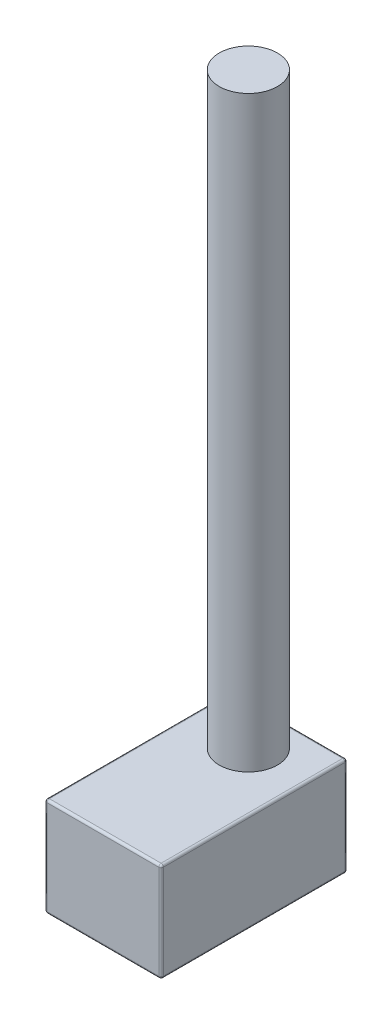
ISO-10303-21;
HEADER;
FILE_DESCRIPTION(('STEP AP214'),'2;1');
FILE_NAME('part.step','',(''),(''),'','','');
FILE_SCHEMA(('AUTOMOTIVE_DESIGN { 1 0 10303 214 1 1 1 1 }'));
ENDSEC;
DATA;
#1=APPLICATION_CONTEXT('core data for automotive mechanical design processes');
#2=APPLICATION_PROTOCOL_DEFINITION('international standard','automotive_design',2000,#1);
#3=PRODUCT_CONTEXT('',#1,'mechanical');
#4=PRODUCT('Part','Part','',(#3));
#5=PRODUCT_RELATED_PRODUCT_CATEGORY('part','',(#4));
#6=PRODUCT_DEFINITION_FORMATION('','',#4);
#7=PRODUCT_DEFINITION_CONTEXT('part definition',#1,'design');
#8=PRODUCT_DEFINITION('design','',#6,#7);
#9=PRODUCT_DEFINITION_SHAPE('','',#8);
#10=(LENGTH_UNIT() NAMED_UNIT(*) SI_UNIT(.MILLI.,.METRE.));
#11=(NAMED_UNIT(*) PLANE_ANGLE_UNIT() SI_UNIT($,.RADIAN.));
#12=(NAMED_UNIT(*) SI_UNIT($,.STERADIAN.) SOLID_ANGLE_UNIT());
#13=UNCERTAINTY_MEASURE_WITH_UNIT(LENGTH_MEASURE(1.E-05),#10,'distance_accuracy_value','');
#14=(GEOMETRIC_REPRESENTATION_CONTEXT(3) GLOBAL_UNCERTAINTY_ASSIGNED_CONTEXT((#13)) GLOBAL_UNIT_ASSIGNED_CONTEXT((#10,
#11,#12)) REPRESENTATION_CONTEXT('',''));
#15=CARTESIAN_POINT('',(0.,0.,0.));
#16=DIRECTION('',(0.,0.,1.));
#17=DIRECTION('',(1.,0.,0.));
#18=AXIS2_PLACEMENT_3D('',#15,#16,#17);
#19=CARTESIAN_POINT('',(-60.009659713746,85.,-18.5580204778157));
#20=DIRECTION('',(1.,0.,0.));
#21=DIRECTION('',(0.,0.,-1.));
#22=AXIS2_PLACEMENT_3D('',#19,#20,#21);
#23=PLANE('',#22);
#24=DIRECTION('',(0.,1.,0.));
#25=VECTOR('',#24,1.);
#26=CARTESIAN_POINT('',(-60.009659713746,85.,80.6780797430993));
#27=LINE('',#26,#25);
#28=CARTESIAN_POINT('',(-60.009659713746,83.,80.6780797430993));
#29=VERTEX_POINT('',#28);
#30=CARTESIAN_POINT('',(-60.009659713746,2.,80.6780797430993));
#31=VERTEX_POINT('',#30);
#32=EDGE_CURVE('E227',#29,#31,#27,.F.);
#33=ORIENTED_EDGE('',*,*,#32,.T.);
#34=DIRECTION('',(0.,0.,1.));
#35=VECTOR('',#34,1.);
#36=CARTESIAN_POINT('',(-60.009659713746,2.,-18.5580204778157));
#37=LINE('',#36,#35);
#38=CARTESIAN_POINT('',(-60.009659713746,2.,139.441979522184));
#39=VERTEX_POINT('',#38);
#40=EDGE_CURVE('E330',#31,#39,#37,.T.);
#41=ORIENTED_EDGE('',*,*,#40,.T.);
#42=DIRECTION('',(0.,-1.,0.));
#43=VECTOR('',#42,1.);
#44=CARTESIAN_POINT('',(-60.009659713746,85.,139.441979522184));
#45=LINE('',#44,#43);
#46=CARTESIAN_POINT('',(-60.009659713746,83.,139.441979522184));
#47=VERTEX_POINT('',#46);
#48=EDGE_CURVE('E328',#39,#47,#45,.F.);
#49=ORIENTED_EDGE('',*,*,#48,.T.);
#50=DIRECTION('',(0.,0.,1.));
#51=VECTOR('',#50,1.);
#52=CARTESIAN_POINT('',(-60.009659713746,83.,-18.5580204778157));
#53=LINE('',#52,#51);
#54=EDGE_CURVE('E270',#47,#29,#53,.F.);
#55=ORIENTED_EDGE('',*,*,#54,.T.);
#56=EDGE_LOOP('',(#33,#41,#49,#55));
#57=FACE_BOUND('',#56,.T.);
#58=ADVANCED_FACE('F37',(#57),#23,.F.);
#59=DIRECTION('',(0.,0.,1.));
#60=VECTOR('',#59,1.);
#61=CARTESIAN_POINT('',(-60.009659713746,83.,-18.5580204778157));
#62=LINE('',#61,#60);
#63=CARTESIAN_POINT('',(-60.009659713746,83.,51.6780797430993));
#64=VERTEX_POINT('',#63);
#65=CARTESIAN_POINT('',(-60.009659713746,83.,-16.5580204778157));
#66=VERTEX_POINT('',#65);
#67=EDGE_CURVE('E267',#64,#66,#62,.F.);
#68=ORIENTED_EDGE('',*,*,#67,.T.);
#69=DIRECTION('',(0.,-1.,0.));
#70=VECTOR('',#69,1.);
#71=CARTESIAN_POINT('',(-60.009659713746,85.,-16.5580204778157));
#72=LINE('',#71,#70);
#73=CARTESIAN_POINT('',(-60.009659713746,2.,-16.5580204778157));
#74=VERTEX_POINT('',#73);
#75=EDGE_CURVE('E320',#66,#74,#72,.T.);
#76=ORIENTED_EDGE('',*,*,#75,.T.);
#77=DIRECTION('',(0.,0.,1.));
#78=VECTOR('',#77,1.);
#79=CARTESIAN_POINT('',(-60.009659713746,2.,-18.5580204778157));
#80=LINE('',#79,#78);
#81=CARTESIAN_POINT('',(-60.009659713746,2.,51.6780797430993));
#82=VERTEX_POINT('',#81);
#83=EDGE_CURVE('E318',#74,#82,#80,.T.);
#84=ORIENTED_EDGE('',*,*,#83,.T.);
#85=DIRECTION('',(0.,-1.,0.));
#86=VECTOR('',#85,1.);
#87=CARTESIAN_POINT('',(-60.009659713746,85.,51.6780797430993));
#88=LINE('',#87,#86);
#89=EDGE_CURVE('E231',#82,#64,#88,.F.);
#90=ORIENTED_EDGE('',*,*,#89,.T.);
#91=EDGE_LOOP('',(#68,#76,#84,#90));
#92=FACE_BOUND('',#91,.T.);
#93=ADVANCED_FACE('F533',(#92),#23,.F.);
#94=CARTESIAN_POINT('',(-60.009659713746,85.,141.441979522184));
#95=DIRECTION('',(0.,0.,-1.));
#96=DIRECTION('',(-1.,0.,0.));
#97=AXIS2_PLACEMENT_3D('',#94,#95,#96);
#98=PLANE('',#97);
#99=DIRECTION('',(1.,0.,0.));
#100=VECTOR('',#99,1.);
#101=CARTESIAN_POINT('',(-60.009659713746,2.,141.441979522184));
#102=LINE('',#101,#100);
#103=CARTESIAN_POINT('',(-58.009659713746,2.,141.441979522184));
#104=VERTEX_POINT('',#103);
#105=CARTESIAN_POINT('',(37.990340286254,2.,141.441979522184));
#106=VERTEX_POINT('',#105);
#107=EDGE_CURVE('E54',#104,#106,#102,.T.);
#108=ORIENTED_EDGE('',*,*,#107,.T.);
#109=DIRECTION('',(0.,-1.,0.));
#110=VECTOR('',#109,1.);
#111=CARTESIAN_POINT('',(37.990340286254,85.,141.441979522184));
#112=LINE('',#111,#110);
#113=CARTESIAN_POINT('',(37.990340286254,83.,141.441979522184));
#114=VERTEX_POINT('',#113);
#115=EDGE_CURVE('E340',#106,#114,#112,.F.);
#116=ORIENTED_EDGE('',*,*,#115,.T.);
#117=DIRECTION('',(1.,0.,0.));
#118=VECTOR('',#117,1.);
#119=CARTESIAN_POINT('',(-60.009659713746,83.,141.441979522184));
#120=LINE('',#119,#118);
#121=CARTESIAN_POINT('',(-58.009659713746,83.,141.441979522184));
#122=VERTEX_POINT('',#121);
#123=EDGE_CURVE('E277',#114,#122,#120,.F.);
#124=ORIENTED_EDGE('',*,*,#123,.T.);
#125=DIRECTION('',(0.,-1.,0.));
#126=VECTOR('',#125,1.);
#127=CARTESIAN_POINT('',(-58.009659713746,85.,141.441979522184));
#128=LINE('',#127,#126);
#129=EDGE_CURVE('E59',#122,#104,#128,.T.);
#130=ORIENTED_EDGE('',*,*,#129,.T.);
#131=EDGE_LOOP('',(#108,#116,#124,#130));
#132=FACE_BOUND('',#131,.T.);
#133=ADVANCED_FACE('F433',(#132),#98,.F.);
#134=CARTESIAN_POINT('',(39.990340286254,85.,-18.5580204778157));
#135=DIRECTION('',(-1.,0.,0.));
#136=DIRECTION('',(0.,0.,1.));
#137=AXIS2_PLACEMENT_3D('',#134,#135,#136);
#138=PLANE('',#137);
#139=DIRECTION('',(0.,0.,-1.));
#140=VECTOR('',#139,1.);
#141=CARTESIAN_POINT('',(39.990340286254,2.,-18.5580204778157));
#142=LINE('',#141,#140);
#143=CARTESIAN_POINT('',(39.990340286254,2.,139.441979522184));
#144=VERTEX_POINT('',#143);
#145=CARTESIAN_POINT('',(39.990340286254,2.,-16.5580204778157));
#146=VERTEX_POINT('',#145);
#147=EDGE_CURVE('E334',#144,#146,#142,.T.);
#148=ORIENTED_EDGE('',*,*,#147,.T.);
#149=DIRECTION('',(0.,-1.,0.));
#150=VECTOR('',#149,1.);
#151=CARTESIAN_POINT('',(39.990340286254,85.,-16.5580204778157));
#152=LINE('',#151,#150);
#153=CARTESIAN_POINT('',(39.990340286254,83.,-16.5580204778157));
#154=VERTEX_POINT('',#153);
#155=EDGE_CURVE('E336',#146,#154,#152,.F.);
#156=ORIENTED_EDGE('',*,*,#155,.T.);
#157=DIRECTION('',(0.,0.,-1.));
#158=VECTOR('',#157,1.);
#159=CARTESIAN_POINT('',(39.990340286254,83.,141.441979522184));
#160=LINE('',#159,#158);
#161=CARTESIAN_POINT('',(39.990340286254,83.,139.441979522184));
#162=VERTEX_POINT('',#161);
#163=EDGE_CURVE('E264',#154,#162,#160,.F.);
#164=ORIENTED_EDGE('',*,*,#163,.T.);
#165=DIRECTION('',(0.,-1.,0.));
#166=VECTOR('',#165,1.);
#167=CARTESIAN_POINT('',(39.990340286254,85.,139.441979522184));
#168=LINE('',#167,#166);
#169=EDGE_CURVE('E332',#162,#144,#168,.T.);
#170=ORIENTED_EDGE('',*,*,#169,.T.);
#171=EDGE_LOOP('',(#148,#156,#164,#170));
#172=FACE_BOUND('',#171,.T.);
#173=ADVANCED_FACE('F449',(#172),#138,.F.);
#174=CARTESIAN_POINT('',(-60.009659713746,85.,-18.5580204778157));
#175=DIRECTION('',(0.,0.,1.));
#176=DIRECTION('',(1.,0.,0.));
#177=AXIS2_PLACEMENT_3D('',#174,#175,#176);
#178=PLANE('',#177);
#179=DIRECTION('',(-1.,0.,0.));
#180=VECTOR('',#179,1.);
#181=CARTESIAN_POINT('',(-60.009659713746,2.,-18.5580204778157));
#182=LINE('',#181,#180);
#183=CARTESIAN_POINT('',(37.990340286254,2.,-18.5580204778157));
#184=VERTEX_POINT('',#183);
#185=CARTESIAN_POINT('',(-58.009659713746,2.,-18.5580204778157));
#186=VERTEX_POINT('',#185);
#187=EDGE_CURVE('E324',#184,#186,#182,.T.);
#188=ORIENTED_EDGE('',*,*,#187,.T.);
#189=DIRECTION('',(0.,-1.,0.));
#190=VECTOR('',#189,1.);
#191=CARTESIAN_POINT('',(-58.009659713746,85.,-18.5580204778157));
#192=LINE('',#191,#190);
#193=CARTESIAN_POINT('',(-58.009659713746,83.,-18.5580204778157));
#194=VERTEX_POINT('',#193);
#195=EDGE_CURVE('E326',#186,#194,#192,.F.);
#196=ORIENTED_EDGE('',*,*,#195,.T.);
#197=DIRECTION('',(-1.,0.,0.));
#198=VECTOR('',#197,1.);
#199=CARTESIAN_POINT('',(39.990340286254,83.,-18.5580204778157));
#200=LINE('',#199,#198);
#201=CARTESIAN_POINT('',(37.990340286254,83.,-18.5580204778157));
#202=VERTEX_POINT('',#201);
#203=EDGE_CURVE('E261',#194,#202,#200,.F.);
#204=ORIENTED_EDGE('',*,*,#203,.T.);
#205=DIRECTION('',(0.,-1.,0.));
#206=VECTOR('',#205,1.);
#207=CARTESIAN_POINT('',(37.990340286254,85.,-18.5580204778157));
#208=LINE('',#207,#206);
#209=EDGE_CURVE('E322',#202,#184,#208,.T.);
#210=ORIENTED_EDGE('',*,*,#209,.T.);
#211=EDGE_LOOP('',(#188,#196,#204,#210));
#212=FACE_BOUND('',#211,.T.);
#213=ADVANCED_FACE('F470',(#212),#178,.F.);
#214=CARTESIAN_POINT('',(0.,85.,0.));
#215=DIRECTION('',(0.,1.,0.));
#216=DIRECTION('',(0.,0.,1.));
#217=AXIS2_PLACEMENT_3D('',#214,#215,#216);
#218=PLANE('',#217);
#219=DIRECTION('',(0.,0.,-1.));
#220=VECTOR('',#219,1.);
#221=CARTESIAN_POINT('',(37.990340286254,85.,-18.5580204778157));
#222=LINE('',#221,#220);
#223=CARTESIAN_POINT('',(37.990340286254,85.,139.441979522184));
#224=VERTEX_POINT('',#223);
#225=CARTESIAN_POINT('',(37.990340286254,85.,-16.5580204778157));
#226=VERTEX_POINT('',#225);
#227=EDGE_CURVE('E255',#224,#226,#222,.T.);
#228=ORIENTED_EDGE('',*,*,#227,.T.);
#229=DIRECTION('',(-1.,0.,0.));
#230=VECTOR('',#229,1.);
#231=CARTESIAN_POINT('',(-60.009659713746,85.,-16.5580204778157));
#232=LINE('',#231,#230);
#233=CARTESIAN_POINT('',(-58.009659713746,85.,-16.5580204778157));
#234=VERTEX_POINT('',#233);
#235=EDGE_CURVE('E258',#226,#234,#232,.T.);
#236=ORIENTED_EDGE('',*,*,#235,.T.);
#237=DIRECTION('',(0.,0.,1.));
#238=VECTOR('',#237,1.);
#239=CARTESIAN_POINT('',(-58.009659713746,85.,141.441979522184));
#240=LINE('',#239,#238);
#241=CARTESIAN_POINT('',(-58.009659713746,85.,139.441979522184));
#242=VERTEX_POINT('',#241);
#243=EDGE_CURVE('E252',#234,#242,#240,.T.);
#244=ORIENTED_EDGE('',*,*,#243,.T.);
#245=DIRECTION('',(1.,0.,0.));
#246=VECTOR('',#245,1.);
#247=CARTESIAN_POINT('',(39.990340286254,85.,139.441979522184));
#248=LINE('',#247,#246);
#249=EDGE_CURVE('E249',#242,#224,#248,.T.);
#250=ORIENTED_EDGE('',*,*,#249,.T.);
#251=EDGE_LOOP('',(#228,#236,#244,#250));
#252=FACE_BOUND('',#251,.T.);
#253=CARTESIAN_POINT('',(-10.009659713746,85.,16.4419795221843));
#254=DIRECTION('',(0.,1.,0.));
#255=DIRECTION('',(0.,0.,1.));
#256=AXIS2_PLACEMENT_3D('',#253,#254,#255);
#257=CIRCLE('',#256,25.);
#258=CARTESIAN_POINT('',(-10.009659713746,85.,41.4419795221843));
#259=VERTEX_POINT('',#258);
#260=EDGE_CURVE('E228',#259,#259,#257,.F.);
#261=ORIENTED_EDGE('',*,*,#260,.T.);
#262=EDGE_LOOP('',(#261));
#263=FACE_BOUND('',#262,.T.);
#264=ADVANCED_FACE('F480',(#252,#263),#218,.T.);
#265=CARTESIAN_POINT('',(0.,0.,0.));
#266=DIRECTION('',(0.,1.,0.));
#267=DIRECTION('',(0.,0.,1.));
#268=AXIS2_PLACEMENT_3D('',#265,#266,#267);
#269=PLANE('',#268);
#270=DIRECTION('',(-1.,0.,0.));
#271=VECTOR('',#270,1.);
#272=CARTESIAN_POINT('',(0.,0.,80.6780797430993));
#273=LINE('',#272,#271);
#274=CARTESIAN_POINT('',(-58.009659713746,0.,80.6780797430993));
#275=VERTEX_POINT('',#274);
#276=CARTESIAN_POINT('',(9.99034028625402,0.,80.6780797430993));
#277=VERTEX_POINT('',#276);
#278=EDGE_CURVE('E302',#275,#277,#273,.F.);
#279=ORIENTED_EDGE('',*,*,#278,.T.);
#280=DIRECTION('',(0.,0.,1.));
#281=VECTOR('',#280,1.);
#282=CARTESIAN_POINT('',(9.99034028625402,0.,53.6780797430993));
#283=LINE('',#282,#281);
#284=CARTESIAN_POINT('',(9.99034028625402,0.,51.6780797430993));
#285=VERTEX_POINT('',#284);
#286=EDGE_CURVE('E413',#285,#277,#283,.T.);
#287=ORIENTED_EDGE('',*,*,#286,.F.);
#288=DIRECTION('',(-1.,0.,0.));
#289=VECTOR('',#288,1.);
#290=CARTESIAN_POINT('',(0.,0.,51.6780797430993));
#291=LINE('',#290,#289);
#292=CARTESIAN_POINT('',(-58.009659713746,0.,51.6780797430993));
#293=VERTEX_POINT('',#292);
#294=EDGE_CURVE('E300',#285,#293,#291,.T.);
#295=ORIENTED_EDGE('',*,*,#294,.T.);
#296=DIRECTION('',(0.,0.,1.));
#297=VECTOR('',#296,1.);
#298=CARTESIAN_POINT('',(-58.009659713746,0.,0.));
#299=LINE('',#298,#297);
#300=CARTESIAN_POINT('',(-58.009659713746,0.,-16.5580204778157));
#301=VERTEX_POINT('',#300);
#302=EDGE_CURVE('E296',#293,#301,#299,.F.);
#303=ORIENTED_EDGE('',*,*,#302,.T.);
#304=DIRECTION('',(-1.,0.,0.));
#305=VECTOR('',#304,1.);
#306=CARTESIAN_POINT('',(0.,0.,-16.5580204778157));
#307=LINE('',#306,#305);
#308=CARTESIAN_POINT('',(37.990340286254,0.,-16.5580204778157));
#309=VERTEX_POINT('',#308);
#310=EDGE_CURVE('E294',#301,#309,#307,.F.);
#311=ORIENTED_EDGE('',*,*,#310,.T.);
#312=DIRECTION('',(0.,0.,-1.));
#313=VECTOR('',#312,1.);
#314=CARTESIAN_POINT('',(37.990340286254,0.,0.));
#315=LINE('',#314,#313);
#316=CARTESIAN_POINT('',(37.990340286254,0.,139.441979522184));
#317=VERTEX_POINT('',#316);
#318=EDGE_CURVE('E292',#309,#317,#315,.F.);
#319=ORIENTED_EDGE('',*,*,#318,.T.);
#320=DIRECTION('',(1.,0.,0.));
#321=VECTOR('',#320,1.);
#322=CARTESIAN_POINT('',(0.,0.,139.441979522184));
#323=LINE('',#322,#321);
#324=CARTESIAN_POINT('',(-58.009659713746,0.,139.441979522184));
#325=VERTEX_POINT('',#324);
#326=EDGE_CURVE('E290',#317,#325,#323,.F.);
#327=ORIENTED_EDGE('',*,*,#326,.T.);
#328=DIRECTION('',(0.,0.,1.));
#329=VECTOR('',#328,1.);
#330=CARTESIAN_POINT('',(-58.009659713746,0.,0.));
#331=LINE('',#330,#329);
#332=EDGE_CURVE('E298',#325,#275,#331,.F.);
#333=ORIENTED_EDGE('',*,*,#332,.T.);
#334=EDGE_LOOP('',(#279,#287,#295,#303,#311,#319,#327,#333));
#335=FACE_BOUND('',#334,.T.);
#336=ADVANCED_FACE('F412',(#335),#269,.F.);
#337=CARTESIAN_POINT('',(-10.009659713746,590.,16.4419795221843));
#338=DIRECTION('',(0.,-1.,0.));
#339=DIRECTION('',(0.,0.,-1.));
#340=AXIS2_PLACEMENT_3D('',#337,#338,#339);
#341=CYLINDRICAL_SURFACE('',#340,25.);
#342=ORIENTED_EDGE('',*,*,#260,.F.);
#343=EDGE_LOOP('',(#342));
#344=FACE_BOUND('',#343,.T.);
#345=CARTESIAN_POINT('',(-10.009659713746,590.,16.4419795221843));
#346=DIRECTION('',(0.,1.,0.));
#347=DIRECTION('',(0.,0.,1.));
#348=AXIS2_PLACEMENT_3D('',#345,#346,#347);
#349=CIRCLE('',#348,25.);
#350=CARTESIAN_POINT('',(-10.009659713746,590.,41.4419795221843));
#351=VERTEX_POINT('',#350);
#352=EDGE_CURVE('E198',#351,#351,#349,.T.);
#353=ORIENTED_EDGE('',*,*,#352,.F.);
#354=EDGE_LOOP('',(#353));
#355=FACE_BOUND('',#354,.T.);
#356=ADVANCED_FACE('F519',(#344,#355),#341,.T.);
#357=CARTESIAN_POINT('',(-10.009659713746,590.,16.4419795221843));
#358=DIRECTION('',(0.,1.,0.));
#359=DIRECTION('',(0.,0.,1.));
#360=AXIS2_PLACEMENT_3D('',#357,#358,#359);
#361=PLANE('',#360);
#362=ORIENTED_EDGE('',*,*,#352,.T.);
#363=EDGE_LOOP('',(#362));
#364=FACE_BOUND('',#363,.T.);
#365=ADVANCED_FACE('F517',(#364),#361,.T.);
#366=CARTESIAN_POINT('',(9.99034028625402,0.,78.6780797430993));
#367=DIRECTION('',(0.,0.,1.));
#368=DIRECTION('',(1.,0.,0.));
#369=AXIS2_PLACEMENT_3D('',#366,#367,#368);
#370=PLANE('',#369);
#371=DIRECTION('',(0.,1.,0.));
#372=VECTOR('',#371,1.);
#373=CARTESIAN_POINT('',(9.99034028625402,0.,78.6780797430993));
#374=LINE('',#373,#372);
#375=CARTESIAN_POINT('',(9.99034028625402,2.,78.6780797430993));
#376=VERTEX_POINT('',#375);
#377=CARTESIAN_POINT('',(9.99034028625402,77.,78.6780797430993));
#378=VERTEX_POINT('',#377);
#379=EDGE_CURVE('E240',#376,#378,#374,.T.);
#380=ORIENTED_EDGE('',*,*,#379,.F.);
#381=DIRECTION('',(-1.,0.,0.));
#382=VECTOR('',#381,1.);
#383=CARTESIAN_POINT('',(9.99034028625402,2.,78.6780797430993));
#384=LINE('',#383,#382);
#385=CARTESIAN_POINT('',(-58.009659713746,2.,78.6780797430993));
#386=VERTEX_POINT('',#385);
#387=EDGE_CURVE('E288',#376,#386,#384,.T.);
#388=ORIENTED_EDGE('',*,*,#387,.T.);
#389=DIRECTION('',(0.,1.,0.));
#390=VECTOR('',#389,1.);
#391=CARTESIAN_POINT('',(-58.009659713746,0.,78.6780797430993));
#392=LINE('',#391,#390);
#393=CARTESIAN_POINT('',(-58.009659713746,82.,78.6780797430993));
#394=VERTEX_POINT('',#393);
#395=EDGE_CURVE('E211',#386,#394,#392,.T.);
#396=ORIENTED_EDGE('',*,*,#395,.T.);
#397=DIRECTION('',(-1.,0.,0.));
#398=VECTOR('',#397,1.);
#399=CARTESIAN_POINT('',(9.99034028625402,82.,78.6780797430993));
#400=LINE('',#399,#398);
#401=CARTESIAN_POINT('',(4.99034028625402,82.,78.6780797430993));
#402=VERTEX_POINT('',#401);
#403=EDGE_CURVE('E199',#402,#394,#400,.T.);
#404=ORIENTED_EDGE('',*,*,#403,.F.);
#405=CARTESIAN_POINT('',(4.99034028625402,77.,78.6780797430993));
#406=DIRECTION('',(0.,0.,1.));
#407=DIRECTION('',(1.,0.,0.));
#408=AXIS2_PLACEMENT_3D('',#405,#406,#407);
#409=CIRCLE('',#408,5.);
#410=EDGE_CURVE('E246',#402,#378,#409,.F.);
#411=ORIENTED_EDGE('',*,*,#410,.T.);
#412=EDGE_LOOP('',(#380,#388,#396,#404,#411));
#413=FACE_BOUND('',#412,.T.);
#414=ADVANCED_FACE('F504',(#413),#370,.F.);
#415=CARTESIAN_POINT('',(9.99034028625402,0.,53.6780797430993));
#416=DIRECTION('',(0.,0.,-1.));
#417=DIRECTION('',(-1.,0.,0.));
#418=AXIS2_PLACEMENT_3D('',#415,#416,#417);
#419=PLANE('',#418);
#420=DIRECTION('',(0.,-1.,0.));
#421=VECTOR('',#420,1.);
#422=CARTESIAN_POINT('',(-58.009659713746,0.,53.6780797430993));
#423=LINE('',#422,#421);
#424=CARTESIAN_POINT('',(-58.009659713746,82.,53.6780797430993));
#425=VERTEX_POINT('',#424);
#426=CARTESIAN_POINT('',(-58.009659713746,2.,53.6780797430993));
#427=VERTEX_POINT('',#426);
#428=EDGE_CURVE('E192',#425,#427,#423,.T.);
#429=ORIENTED_EDGE('',*,*,#428,.T.);
#430=DIRECTION('',(-1.,0.,0.));
#431=VECTOR('',#430,1.);
#432=CARTESIAN_POINT('',(9.99034028625402,2.,53.6780797430993));
#433=LINE('',#432,#431);
#434=CARTESIAN_POINT('',(9.99034028625402,2.,53.6780797430993));
#435=VERTEX_POINT('',#434);
#436=EDGE_CURVE('E307',#427,#435,#433,.F.);
#437=ORIENTED_EDGE('',*,*,#436,.T.);
#438=DIRECTION('',(0.,-1.,0.));
#439=VECTOR('',#438,1.);
#440=CARTESIAN_POINT('',(9.99034028625402,0.,53.6780797430993));
#441=LINE('',#440,#439);
#442=CARTESIAN_POINT('',(9.99034028625402,77.,53.6780797430993));
#443=VERTEX_POINT('',#442);
#444=EDGE_CURVE('E508',#443,#435,#441,.T.);
#445=ORIENTED_EDGE('',*,*,#444,.F.);
#446=CARTESIAN_POINT('',(4.99034028625402,77.,53.6780797430993));
#447=DIRECTION('',(0.,0.,-1.));
#448=DIRECTION('',(-1.,0.,0.));
#449=AXIS2_PLACEMENT_3D('',#446,#447,#448);
#450=CIRCLE('',#449,5.);
#451=CARTESIAN_POINT('',(4.99034028625402,82.,53.6780797430993));
#452=VERTEX_POINT('',#451);
#453=EDGE_CURVE('E195',#443,#452,#450,.F.);
#454=ORIENTED_EDGE('',*,*,#453,.T.);
#455=DIRECTION('',(-1.,0.,0.));
#456=VECTOR('',#455,1.);
#457=CARTESIAN_POINT('',(9.99034028625402,82.,53.6780797430993));
#458=LINE('',#457,#456);
#459=EDGE_CURVE('E188',#452,#425,#458,.T.);
#460=ORIENTED_EDGE('',*,*,#459,.T.);
#461=EDGE_LOOP('',(#429,#437,#445,#454,#460));
#462=FACE_BOUND('',#461,.T.);
#463=ADVANCED_FACE('F190',(#462),#419,.F.);
#464=CARTESIAN_POINT('',(9.99034028625402,82.,53.6780797430993));
#465=DIRECTION('',(0.,1.,0.));
#466=DIRECTION('',(0.,0.,1.));
#467=AXIS2_PLACEMENT_3D('',#464,#465,#466);
#468=PLANE('',#467);
#469=ORIENTED_EDGE('',*,*,#459,.F.);
#470=DIRECTION('',(0.,0.,-1.));
#471=VECTOR('',#470,1.);
#472=CARTESIAN_POINT('',(4.99034028625402,82.,78.6780797430993));
#473=LINE('',#472,#471);
#474=EDGE_CURVE('E244',#452,#402,#473,.F.);
#475=ORIENTED_EDGE('',*,*,#474,.T.);
#476=ORIENTED_EDGE('',*,*,#403,.T.);
#477=DIRECTION('',(0.,0.,-1.));
#478=VECTOR('',#477,1.);
#479=CARTESIAN_POINT('',(-58.009659713746,82.,53.6780797430993));
#480=LINE('',#479,#478);
#481=EDGE_CURVE('E203',#394,#425,#480,.T.);
#482=ORIENTED_EDGE('',*,*,#481,.T.);
#483=EDGE_LOOP('',(#469,#475,#476,#482));
#484=FACE_BOUND('',#483,.T.);
#485=ADVANCED_FACE('F205',(#484),#468,.F.);
#486=CARTESIAN_POINT('',(9.99034028625402,0.,0.));
#487=DIRECTION('',(1.,0.,0.));
#488=DIRECTION('',(0.,0.,-1.));
#489=AXIS2_PLACEMENT_3D('',#486,#487,#488);
#490=PLANE('',#489);
#491=ORIENTED_EDGE('',*,*,#286,.T.);
#492=CARTESIAN_POINT('',(9.99034028625402,2.,80.6780797430993));
#493=DIRECTION('',(1.,0.,0.));
#494=DIRECTION('',(0.,0.,-1.));
#495=AXIS2_PLACEMENT_3D('',#492,#493,#494);
#496=CIRCLE('',#495,2.);
#497=EDGE_CURVE('E46',#277,#376,#496,.T.);
#498=ORIENTED_EDGE('',*,*,#497,.T.);
#499=ORIENTED_EDGE('',*,*,#379,.T.);
#500=DIRECTION('',(0.,0.,-1.));
#501=VECTOR('',#500,1.);
#502=CARTESIAN_POINT('',(9.99034028625402,77.,53.6780797430993));
#503=LINE('',#502,#501);
#504=EDGE_CURVE('E210',#378,#443,#503,.T.);
#505=ORIENTED_EDGE('',*,*,#504,.T.);
#506=ORIENTED_EDGE('',*,*,#444,.T.);
#507=CARTESIAN_POINT('',(9.99034028625402,2.,51.6780797430993));
#508=DIRECTION('',(1.,0.,0.));
#509=DIRECTION('',(0.,0.,-1.));
#510=AXIS2_PLACEMENT_3D('',#507,#508,#509);
#511=CIRCLE('',#510,2.);
#512=EDGE_CURVE('E12',#435,#285,#511,.T.);
#513=ORIENTED_EDGE('',*,*,#512,.T.);
#514=EDGE_LOOP('',(#491,#498,#499,#505,#506,#513));
#515=FACE_BOUND('',#514,.T.);
#516=ADVANCED_FACE('F549',(#515),#490,.F.);
#517=CARTESIAN_POINT('',(-58.009659713746,0.,80.6780797430993));
#518=DIRECTION('',(0.,1.,0.));
#519=DIRECTION('',(0.,0.,1.));
#520=AXIS2_PLACEMENT_3D('',#517,#518,#519);
#521=CYLINDRICAL_SURFACE('',#520,2.);
#522=ORIENTED_EDGE('',*,*,#395,.F.);
#523=CARTESIAN_POINT('',(-58.009659713746,2.,80.6780797430993));
#524=DIRECTION('',(0.,1.,0.));
#525=DIRECTION('',(0.,0.,1.));
#526=AXIS2_PLACEMENT_3D('',#523,#524,#525);
#527=CIRCLE('',#526,2.);
#528=EDGE_CURVE('E305',#386,#31,#527,.T.);
#529=ORIENTED_EDGE('',*,*,#528,.T.);
#530=ORIENTED_EDGE('',*,*,#32,.F.);
#531=CARTESIAN_POINT('',(-58.009659713746,83.,80.6780797430993));
#532=DIRECTION('',(0.,0.707106781186547,0.707106781186547));
#533=DIRECTION('',(0.,0.707106781186547,-0.707106781186547));
#534=AXIS2_PLACEMENT_3D('',#531,#532,#533);
#535=ELLIPSE('',#534,2.82842712474619,2.);
#536=CARTESIAN_POINT('',(-59.9461513868497,83.5,80.1780797430993));
#537=VERTEX_POINT('',#536);
#538=EDGE_CURVE('E272',#29,#537,#535,.F.);
#539=ORIENTED_EDGE('',*,*,#538,.T.);
#540=CARTESIAN_POINT('',(-58.009659713746,84.,80.6780797430993));
#541=DIRECTION('',(0.,0.707106781186547,-0.707106781186547));
#542=DIRECTION('',(0.,0.707106781186547,0.707106781186547));
#543=AXIS2_PLACEMENT_3D('',#540,#541,#542);
#544=ELLIPSE('',#543,2.82842712474619,2.);
#545=EDGE_CURVE('E221',#394,#537,#544,.T.);
#546=ORIENTED_EDGE('',*,*,#545,.F.);
#547=EDGE_LOOP('',(#522,#529,#530,#539,#546));
#548=FACE_BOUND('',#547,.T.);
#549=ADVANCED_FACE('F501',(#548),#521,.T.);
#550=CARTESIAN_POINT('',(-58.009659713746,84.,53.6780797430993));
#551=DIRECTION('',(0.,0.,-1.));
#552=DIRECTION('',(-1.,0.,0.));
#553=AXIS2_PLACEMENT_3D('',#550,#551,#552);
#554=CYLINDRICAL_SURFACE('',#553,2.);
#555=ORIENTED_EDGE('',*,*,#545,.T.);
#556=DIRECTION('',(0.,0.,-1.));
#557=VECTOR('',#556,1.);
#558=CARTESIAN_POINT('',(-59.9461513868497,83.5,80.1780797430993));
#559=LINE('',#558,#557);
#560=CARTESIAN_POINT('',(-59.9461513868497,83.5,52.1780797430992));
#561=VERTEX_POINT('',#560);
#562=EDGE_CURVE('E217',#537,#561,#559,.T.);
#563=ORIENTED_EDGE('',*,*,#562,.T.);
#564=CARTESIAN_POINT('',(-58.009659713746,84.,51.6780797430993));
#565=DIRECTION('',(0.,-0.707106781186547,-0.707106781186547));
#566=DIRECTION('',(0.,-0.707106781186548,0.707106781186547));
#567=AXIS2_PLACEMENT_3D('',#564,#565,#566);
#568=ELLIPSE('',#567,2.82842712474619,2.);
#569=EDGE_CURVE('E214',#425,#561,#568,.T.);
#570=ORIENTED_EDGE('',*,*,#569,.F.);
#571=ORIENTED_EDGE('',*,*,#481,.F.);
#572=EDGE_LOOP('',(#555,#563,#570,#571));
#573=FACE_BOUND('',#572,.T.);
#574=ADVANCED_FACE('F215',(#573),#554,.T.);
#575=CARTESIAN_POINT('',(-58.009659713746,0.,51.6780797430993));
#576=DIRECTION('',(0.,-1.,0.));
#577=DIRECTION('',(0.,0.,-1.));
#578=AXIS2_PLACEMENT_3D('',#575,#576,#577);
#579=CYLINDRICAL_SURFACE('',#578,2.);
#580=ORIENTED_EDGE('',*,*,#89,.F.);
#581=CARTESIAN_POINT('',(-58.009659713746,2.,51.6780797430993));
#582=DIRECTION('',(0.,-1.,0.));
#583=DIRECTION('',(0.,0.,-1.));
#584=AXIS2_PLACEMENT_3D('',#581,#582,#583);
#585=CIRCLE('',#584,2.);
#586=EDGE_CURVE('E226',#82,#427,#585,.F.);
#587=ORIENTED_EDGE('',*,*,#586,.T.);
#588=ORIENTED_EDGE('',*,*,#428,.F.);
#589=ORIENTED_EDGE('',*,*,#569,.T.);
#590=CARTESIAN_POINT('',(-58.009659713746,83.,51.6780797430993));
#591=DIRECTION('',(0.,-0.707106781186548,0.707106781186547));
#592=DIRECTION('',(0.,-0.707106781186547,-0.707106781186547));
#593=AXIS2_PLACEMENT_3D('',#590,#591,#592);
#594=ELLIPSE('',#593,2.82842712474619,2.);
#595=EDGE_CURVE('E275',#561,#64,#594,.T.);
#596=ORIENTED_EDGE('',*,*,#595,.T.);
#597=EDGE_LOOP('',(#580,#587,#588,#589,#596));
#598=FACE_BOUND('',#597,.T.);
#599=ADVANCED_FACE('F224',(#598),#579,.T.);
#600=CARTESIAN_POINT('',(4.99034028625402,77.,0.));
#601=DIRECTION('',(0.,0.,1.));
#602=DIRECTION('',(1.,0.,0.));
#603=AXIS2_PLACEMENT_3D('',#600,#601,#602);
#604=CYLINDRICAL_SURFACE('',#603,5.);
#605=ORIENTED_EDGE('',*,*,#410,.F.);
#606=ORIENTED_EDGE('',*,*,#474,.F.);
#607=ORIENTED_EDGE('',*,*,#453,.F.);
#608=ORIENTED_EDGE('',*,*,#504,.F.);
#609=EDGE_LOOP('',(#605,#606,#607,#608));
#610=FACE_BOUND('',#609,.T.);
#611=ADVANCED_FACE('F545',(#610),#604,.F.);
#612=CARTESIAN_POINT('',(0.,83.,139.441979522184));
#613=DIRECTION('',(-1.,0.,0.));
#614=DIRECTION('',(0.,0.,1.));
#615=AXIS2_PLACEMENT_3D('',#612,#613,#614);
#616=CYLINDRICAL_SURFACE('',#615,2.);
#617=ORIENTED_EDGE('',*,*,#123,.F.);
#618=CARTESIAN_POINT('',(37.990340286254,83.,139.441979522184));
#619=DIRECTION('',(-1.,0.,0.));
#620=DIRECTION('',(0.,0.,1.));
#621=AXIS2_PLACEMENT_3D('',#618,#619,#620);
#622=CIRCLE('',#621,2.);
#623=EDGE_CURVE('E316',#114,#224,#622,.T.);
#624=ORIENTED_EDGE('',*,*,#623,.T.);
#625=ORIENTED_EDGE('',*,*,#249,.F.);
#626=CARTESIAN_POINT('',(-58.009659713746,83.,139.441979522184));
#627=DIRECTION('',(-1.,0.,0.));
#628=DIRECTION('',(0.,0.,1.));
#629=AXIS2_PLACEMENT_3D('',#626,#627,#628);
#630=CIRCLE('',#629,2.);
#631=EDGE_CURVE('E314',#242,#122,#630,.F.);
#632=ORIENTED_EDGE('',*,*,#631,.T.);
#633=EDGE_LOOP('',(#617,#624,#625,#632));
#634=FACE_BOUND('',#633,.T.);
#635=ADVANCED_FACE('F437',(#634),#616,.T.);
#636=CARTESIAN_POINT('',(37.990340286254,83.,0.));
#637=DIRECTION('',(0.,0.,1.));
#638=DIRECTION('',(1.,0.,0.));
#639=AXIS2_PLACEMENT_3D('',#636,#637,#638);
#640=CYLINDRICAL_SURFACE('',#639,2.);
#641=ORIENTED_EDGE('',*,*,#163,.F.);
#642=CARTESIAN_POINT('',(37.990340286254,83.,-16.5580204778157));
#643=DIRECTION('',(0.,0.,1.));
#644=DIRECTION('',(1.,0.,0.));
#645=AXIS2_PLACEMENT_3D('',#642,#643,#644);
#646=CIRCLE('',#645,2.);
#647=EDGE_CURVE('E312',#154,#226,#646,.T.);
#648=ORIENTED_EDGE('',*,*,#647,.T.);
#649=ORIENTED_EDGE('',*,*,#227,.F.);
#650=CARTESIAN_POINT('',(37.990340286254,83.,139.441979522184));
#651=DIRECTION('',(0.,0.,1.));
#652=DIRECTION('',(1.,0.,0.));
#653=AXIS2_PLACEMENT_3D('',#650,#651,#652);
#654=CIRCLE('',#653,2.);
#655=EDGE_CURVE('E310',#224,#162,#654,.F.);
#656=ORIENTED_EDGE('',*,*,#655,.T.);
#657=EDGE_LOOP('',(#641,#648,#649,#656));
#658=FACE_BOUND('',#657,.T.);
#659=ADVANCED_FACE('F446',(#658),#640,.T.);
#660=CARTESIAN_POINT('',(-58.009659713746,83.,0.));
#661=DIRECTION('',(0.,0.,-1.));
#662=DIRECTION('',(-1.,0.,0.));
#663=AXIS2_PLACEMENT_3D('',#660,#661,#662);
#664=CYLINDRICAL_SURFACE('',#663,2.);
#665=ORIENTED_EDGE('',*,*,#243,.F.);
#666=CARTESIAN_POINT('',(-58.009659713746,83.,-16.5580204778157));
#667=DIRECTION('',(0.,0.,-1.));
#668=DIRECTION('',(-1.,0.,0.));
#669=AXIS2_PLACEMENT_3D('',#666,#667,#668);
#670=CIRCLE('',#669,2.);
#671=EDGE_CURVE('E286',#234,#66,#670,.F.);
#672=ORIENTED_EDGE('',*,*,#671,.T.);
#673=ORIENTED_EDGE('',*,*,#67,.F.);
#674=ORIENTED_EDGE('',*,*,#595,.F.);
#675=ORIENTED_EDGE('',*,*,#562,.F.);
#676=ORIENTED_EDGE('',*,*,#538,.F.);
#677=ORIENTED_EDGE('',*,*,#54,.F.);
#678=CARTESIAN_POINT('',(-58.009659713746,83.,139.441979522184));
#679=DIRECTION('',(0.,0.,-1.));
#680=DIRECTION('',(-1.,0.,0.));
#681=AXIS2_PLACEMENT_3D('',#678,#679,#680);
#682=CIRCLE('',#681,2.);
#683=EDGE_CURVE('E284',#47,#242,#682,.T.);
#684=ORIENTED_EDGE('',*,*,#683,.T.);
#685=EDGE_LOOP('',(#665,#672,#673,#674,#675,#676,#677,#684));
#686=FACE_BOUND('',#685,.T.);
#687=ADVANCED_FACE('F487',(#686),#664,.T.);
#688=CARTESIAN_POINT('',(0.,83.,-16.5580204778157));
#689=DIRECTION('',(1.,0.,0.));
#690=DIRECTION('',(0.,0.,-1.));
#691=AXIS2_PLACEMENT_3D('',#688,#689,#690);
#692=CYLINDRICAL_SURFACE('',#691,2.);
#693=ORIENTED_EDGE('',*,*,#203,.F.);
#694=CARTESIAN_POINT('',(-58.009659713746,83.,-16.5580204778157));
#695=DIRECTION('',(1.,0.,0.));
#696=DIRECTION('',(0.,0.,-1.));
#697=AXIS2_PLACEMENT_3D('',#694,#695,#696);
#698=CIRCLE('',#697,2.);
#699=EDGE_CURVE('E281',#194,#234,#698,.T.);
#700=ORIENTED_EDGE('',*,*,#699,.T.);
#701=ORIENTED_EDGE('',*,*,#235,.F.);
#702=CARTESIAN_POINT('',(37.990340286254,83.,-16.5580204778157));
#703=DIRECTION('',(1.,0.,0.));
#704=DIRECTION('',(0.,0.,-1.));
#705=AXIS2_PLACEMENT_3D('',#702,#703,#704);
#706=CIRCLE('',#705,2.);
#707=EDGE_CURVE('E279',#226,#202,#706,.F.);
#708=ORIENTED_EDGE('',*,*,#707,.T.);
#709=EDGE_LOOP('',(#693,#700,#701,#708));
#710=FACE_BOUND('',#709,.T.);
#711=ADVANCED_FACE('F482',(#710),#692,.T.);
#712=CARTESIAN_POINT('',(9.99034028625402,2.,80.6780797430993));
#713=DIRECTION('',(-1.,0.,0.));
#714=DIRECTION('',(0.,0.,1.));
#715=AXIS2_PLACEMENT_3D('',#712,#713,#714);
#716=CYLINDRICAL_SURFACE('',#715,2.);
#717=CARTESIAN_POINT('',(-58.009659713746,2.,80.6780797430993));
#718=DIRECTION('',(-1.,0.,0.));
#719=DIRECTION('',(0.,0.,1.));
#720=AXIS2_PLACEMENT_3D('',#717,#718,#719);
#721=CIRCLE('',#720,2.);
#722=EDGE_CURVE('E41',#386,#275,#721,.T.);
#723=ORIENTED_EDGE('',*,*,#722,.F.);
#724=ORIENTED_EDGE('',*,*,#387,.F.);
#725=ORIENTED_EDGE('',*,*,#497,.F.);
#726=ORIENTED_EDGE('',*,*,#278,.F.);
#727=EDGE_LOOP('',(#723,#724,#725,#726));
#728=FACE_BOUND('',#727,.T.);
#729=ADVANCED_FACE('F39',(#728),#716,.T.);
#730=CARTESIAN_POINT('',(-58.009659713746,2.,80.6780797430993));
#731=DIRECTION('',(0.,1.,0.));
#732=DIRECTION('',(0.,0.,1.));
#733=AXIS2_PLACEMENT_3D('',#730,#731,#732);
#734=SPHERICAL_SURFACE('',#733,2.);
#735=ORIENTED_EDGE('',*,*,#528,.F.);
#736=ORIENTED_EDGE('',*,*,#722,.T.);
#737=CARTESIAN_POINT('',(-58.009659713746,2.,80.6780797430993));
#738=DIRECTION('',(0.,0.,1.));
#739=DIRECTION('',(1.,0.,0.));
#740=AXIS2_PLACEMENT_3D('',#737,#738,#739);
#741=CIRCLE('',#740,2.);
#742=EDGE_CURVE('E396',#31,#275,#741,.T.);
#743=ORIENTED_EDGE('',*,*,#742,.F.);
#744=EDGE_LOOP('',(#735,#736,#743));
#745=FACE_BOUND('',#744,.T.);
#746=ADVANCED_FACE('F406',(#745),#734,.T.);
#747=CARTESIAN_POINT('',(-58.009659713746,83.,139.441979522184));
#748=DIRECTION('',(0.,0.,1.));
#749=DIRECTION('',(1.,0.,0.));
#750=AXIS2_PLACEMENT_3D('',#747,#748,#749);
#751=SPHERICAL_SURFACE('',#750,2.);
#752=ORIENTED_EDGE('',*,*,#631,.F.);
#753=ORIENTED_EDGE('',*,*,#683,.F.);
#754=CARTESIAN_POINT('',(-58.009659713746,83.,139.441979522184));
#755=DIRECTION('',(0.,-1.,0.));
#756=DIRECTION('',(0.,0.,-1.));
#757=AXIS2_PLACEMENT_3D('',#754,#755,#756);
#758=CIRCLE('',#757,2.);
#759=EDGE_CURVE('E394',#122,#47,#758,.T.);
#760=ORIENTED_EDGE('',*,*,#759,.F.);
#761=EDGE_LOOP('',(#752,#753,#760));
#762=FACE_BOUND('',#761,.T.);
#763=ADVANCED_FACE('F492',(#762),#751,.T.);
#764=CARTESIAN_POINT('',(-58.009659713746,2.,-18.5580204778157));
#765=DIRECTION('',(0.,0.,1.));
#766=DIRECTION('',(1.,0.,0.));
#767=AXIS2_PLACEMENT_3D('',#764,#765,#766);
#768=CYLINDRICAL_SURFACE('',#767,2.);
#769=ORIENTED_EDGE('',*,*,#742,.T.);
#770=ORIENTED_EDGE('',*,*,#332,.F.);
#771=CARTESIAN_POINT('',(-58.009659713746,2.,139.441979522184));
#772=DIRECTION('',(0.,0.,1.));
#773=DIRECTION('',(1.,0.,0.));
#774=AXIS2_PLACEMENT_3D('',#771,#772,#773);
#775=CIRCLE('',#774,2.);
#776=EDGE_CURVE('E391',#39,#325,#775,.T.);
#777=ORIENTED_EDGE('',*,*,#776,.F.);
#778=ORIENTED_EDGE('',*,*,#40,.F.);
#779=EDGE_LOOP('',(#769,#770,#777,#778));
#780=FACE_BOUND('',#779,.T.);
#781=ADVANCED_FACE('F416',(#780),#768,.T.);
#782=CARTESIAN_POINT('',(-58.009659713746,85.,139.441979522184));
#783=DIRECTION('',(0.,-1.,0.));
#784=DIRECTION('',(0.,0.,-1.));
#785=AXIS2_PLACEMENT_3D('',#782,#783,#784);
#786=CYLINDRICAL_SURFACE('',#785,2.);
#787=ORIENTED_EDGE('',*,*,#759,.T.);
#788=ORIENTED_EDGE('',*,*,#48,.F.);
#789=CARTESIAN_POINT('',(-58.009659713746,2.,139.441979522184));
#790=DIRECTION('',(0.,-1.,0.));
#791=DIRECTION('',(0.,0.,-1.));
#792=AXIS2_PLACEMENT_3D('',#789,#790,#791);
#793=CIRCLE('',#792,2.);
#794=EDGE_CURVE('E388',#104,#39,#793,.T.);
#795=ORIENTED_EDGE('',*,*,#794,.F.);
#796=ORIENTED_EDGE('',*,*,#129,.F.);
#797=EDGE_LOOP('',(#787,#788,#795,#796));
#798=FACE_BOUND('',#797,.T.);
#799=ADVANCED_FACE('F495',(#798),#786,.T.);
#800=CARTESIAN_POINT('',(-58.009659713746,2.,139.441979522184));
#801=DIRECTION('',(-1.,0.,0.));
#802=DIRECTION('',(0.,-1.,0.));
#803=AXIS2_PLACEMENT_3D('',#800,#801,#802);
#804=SPHERICAL_SURFACE('',#803,2.);
#805=ORIENTED_EDGE('',*,*,#794,.T.);
#806=ORIENTED_EDGE('',*,*,#776,.T.);
#807=CARTESIAN_POINT('',(-58.009659713746,2.,139.441979522184));
#808=DIRECTION('',(-1.,0.,0.));
#809=DIRECTION('',(0.,0.,1.));
#810=AXIS2_PLACEMENT_3D('',#807,#808,#809);
#811=CIRCLE('',#810,2.);
#812=EDGE_CURVE('E385',#104,#325,#811,.F.);
#813=ORIENTED_EDGE('',*,*,#812,.F.);
#814=EDGE_LOOP('',(#805,#806,#813));
#815=FACE_BOUND('',#814,.T.);
#816=ADVANCED_FACE('F419',(#815),#804,.T.);
#817=CARTESIAN_POINT('',(37.990340286254,83.,139.441979522184));
#818=DIRECTION('',(0.,0.,1.));
#819=DIRECTION('',(1.,0.,0.));
#820=AXIS2_PLACEMENT_3D('',#817,#818,#819);
#821=SPHERICAL_SURFACE('',#820,2.);
#822=ORIENTED_EDGE('',*,*,#655,.F.);
#823=ORIENTED_EDGE('',*,*,#623,.F.);
#824=CARTESIAN_POINT('',(37.990340286254,83.,139.441979522184));
#825=DIRECTION('',(0.,-1.,0.));
#826=DIRECTION('',(0.,0.,-1.));
#827=AXIS2_PLACEMENT_3D('',#824,#825,#826);
#828=CIRCLE('',#827,2.);
#829=EDGE_CURVE('E382',#162,#114,#828,.T.);
#830=ORIENTED_EDGE('',*,*,#829,.F.);
#831=EDGE_LOOP('',(#822,#823,#830));
#832=FACE_BOUND('',#831,.T.);
#833=ADVANCED_FACE('F442',(#832),#821,.T.);
#834=CARTESIAN_POINT('',(-60.009659713746,2.,139.441979522184));
#835=DIRECTION('',(1.,0.,0.));
#836=DIRECTION('',(0.,0.,-1.));
#837=AXIS2_PLACEMENT_3D('',#834,#835,#836);
#838=CYLINDRICAL_SURFACE('',#837,2.);
#839=ORIENTED_EDGE('',*,*,#812,.T.);
#840=ORIENTED_EDGE('',*,*,#326,.F.);
#841=CARTESIAN_POINT('',(37.990340286254,2.,139.441979522184));
#842=DIRECTION('',(1.,0.,0.));
#843=DIRECTION('',(0.,0.,-1.));
#844=AXIS2_PLACEMENT_3D('',#841,#842,#843);
#845=CIRCLE('',#844,2.);
#846=EDGE_CURVE('E379',#106,#317,#845,.T.);
#847=ORIENTED_EDGE('',*,*,#846,.F.);
#848=ORIENTED_EDGE('',*,*,#107,.F.);
#849=EDGE_LOOP('',(#839,#840,#847,#848));
#850=FACE_BOUND('',#849,.T.);
#851=ADVANCED_FACE('F421',(#850),#838,.T.);
#852=CARTESIAN_POINT('',(37.990340286254,85.,139.441979522184));
#853=DIRECTION('',(0.,-1.,0.));
#854=DIRECTION('',(0.,0.,-1.));
#855=AXIS2_PLACEMENT_3D('',#852,#853,#854);
#856=CYLINDRICAL_SURFACE('',#855,2.);
#857=ORIENTED_EDGE('',*,*,#829,.T.);
#858=ORIENTED_EDGE('',*,*,#115,.F.);
#859=CARTESIAN_POINT('',(37.990340286254,2.,139.441979522184));
#860=DIRECTION('',(0.,-1.,0.));
#861=DIRECTION('',(0.,0.,-1.));
#862=AXIS2_PLACEMENT_3D('',#859,#860,#861);
#863=CIRCLE('',#862,2.);
#864=EDGE_CURVE('E376',#144,#106,#863,.T.);
#865=ORIENTED_EDGE('',*,*,#864,.F.);
#866=ORIENTED_EDGE('',*,*,#169,.F.);
#867=EDGE_LOOP('',(#857,#858,#865,#866));
#868=FACE_BOUND('',#867,.T.);
#869=ADVANCED_FACE('F430',(#868),#856,.T.);
#870=CARTESIAN_POINT('',(37.990340286254,2.,139.441979522184));
#871=DIRECTION('',(0.,0.,1.));
#872=DIRECTION('',(0.,-1.,0.));
#873=AXIS2_PLACEMENT_3D('',#870,#871,#872);
#874=SPHERICAL_SURFACE('',#873,2.);
#875=ORIENTED_EDGE('',*,*,#864,.T.);
#876=ORIENTED_EDGE('',*,*,#846,.T.);
#877=CARTESIAN_POINT('',(37.990340286254,2.,139.441979522184));
#878=DIRECTION('',(0.,0.,1.));
#879=DIRECTION('',(1.,0.,0.));
#880=AXIS2_PLACEMENT_3D('',#877,#878,#879);
#881=CIRCLE('',#880,2.);
#882=EDGE_CURVE('E373',#144,#317,#881,.F.);
#883=ORIENTED_EDGE('',*,*,#882,.F.);
#884=EDGE_LOOP('',(#875,#876,#883));
#885=FACE_BOUND('',#884,.T.);
#886=ADVANCED_FACE('F426',(#885),#874,.T.);
#887=CARTESIAN_POINT('',(37.990340286254,83.,-16.5580204778157));
#888=DIRECTION('',(0.,0.,1.));
#889=DIRECTION('',(1.,0.,0.));
#890=AXIS2_PLACEMENT_3D('',#887,#888,#889);
#891=SPHERICAL_SURFACE('',#890,2.);
#892=ORIENTED_EDGE('',*,*,#707,.F.);
#893=ORIENTED_EDGE('',*,*,#647,.F.);
#894=CARTESIAN_POINT('',(37.990340286254,83.,-16.5580204778157));
#895=DIRECTION('',(0.,-1.,0.));
#896=DIRECTION('',(0.,0.,-1.));
#897=AXIS2_PLACEMENT_3D('',#894,#895,#896);
#898=CIRCLE('',#897,2.);
#899=EDGE_CURVE('E370',#202,#154,#898,.T.);
#900=ORIENTED_EDGE('',*,*,#899,.F.);
#901=EDGE_LOOP('',(#892,#893,#900));
#902=FACE_BOUND('',#901,.T.);
#903=ADVANCED_FACE('F477',(#902),#891,.T.);
#904=CARTESIAN_POINT('',(0.,2.,51.6780797430993));
#905=DIRECTION('',(-1.,0.,0.));
#906=DIRECTION('',(0.,0.,1.));
#907=AXIS2_PLACEMENT_3D('',#904,#905,#906);
#908=CYLINDRICAL_SURFACE('',#907,2.);
#909=ORIENTED_EDGE('',*,*,#512,.F.);
#910=ORIENTED_EDGE('',*,*,#436,.F.);
#911=CARTESIAN_POINT('',(-58.009659713746,2.,51.6780797430993));
#912=DIRECTION('',(-1.,0.,0.));
#913=DIRECTION('',(0.,0.,1.));
#914=AXIS2_PLACEMENT_3D('',#911,#912,#913);
#915=CIRCLE('',#914,2.);
#916=EDGE_CURVE('E367',#293,#427,#915,.T.);
#917=ORIENTED_EDGE('',*,*,#916,.F.);
#918=ORIENTED_EDGE('',*,*,#294,.F.);
#919=EDGE_LOOP('',(#909,#910,#917,#918));
#920=FACE_BOUND('',#919,.T.);
#921=ADVANCED_FACE('F588',(#920),#908,.T.);
#922=CARTESIAN_POINT('',(37.990340286254,2.,-18.5580204778157));
#923=DIRECTION('',(0.,0.,-1.));
#924=DIRECTION('',(-1.,0.,0.));
#925=AXIS2_PLACEMENT_3D('',#922,#923,#924);
#926=CYLINDRICAL_SURFACE('',#925,2.);
#927=ORIENTED_EDGE('',*,*,#882,.T.);
#928=ORIENTED_EDGE('',*,*,#318,.F.);
#929=CARTESIAN_POINT('',(37.990340286254,2.,-16.5580204778157));
#930=DIRECTION('',(0.,0.,-1.));
#931=DIRECTION('',(-1.,0.,0.));
#932=AXIS2_PLACEMENT_3D('',#929,#930,#931);
#933=CIRCLE('',#932,2.);
#934=EDGE_CURVE('E364',#146,#309,#933,.T.);
#935=ORIENTED_EDGE('',*,*,#934,.F.);
#936=ORIENTED_EDGE('',*,*,#147,.F.);
#937=EDGE_LOOP('',(#927,#928,#935,#936));
#938=FACE_BOUND('',#937,.T.);
#939=ADVANCED_FACE('F460',(#938),#926,.T.);
#940=CARTESIAN_POINT('',(37.990340286254,85.,-16.5580204778157));
#941=DIRECTION('',(0.,-1.,0.));
#942=DIRECTION('',(0.,0.,-1.));
#943=AXIS2_PLACEMENT_3D('',#940,#941,#942);
#944=CYLINDRICAL_SURFACE('',#943,2.);
#945=ORIENTED_EDGE('',*,*,#899,.T.);
#946=ORIENTED_EDGE('',*,*,#155,.F.);
#947=CARTESIAN_POINT('',(37.990340286254,2.,-16.5580204778157));
#948=DIRECTION('',(0.,-1.,0.));
#949=DIRECTION('',(0.,0.,-1.));
#950=AXIS2_PLACEMENT_3D('',#947,#948,#949);
#951=CIRCLE('',#950,2.);
#952=EDGE_CURVE('E361',#184,#146,#951,.T.);
#953=ORIENTED_EDGE('',*,*,#952,.F.);
#954=ORIENTED_EDGE('',*,*,#209,.F.);
#955=EDGE_LOOP('',(#945,#946,#953,#954));
#956=FACE_BOUND('',#955,.T.);
#957=ADVANCED_FACE('F454',(#956),#944,.T.);
#958=CARTESIAN_POINT('',(-58.009659713746,2.,51.6780797430993));
#959=DIRECTION('',(0.,1.,0.));
#960=DIRECTION('',(0.,0.,1.));
#961=AXIS2_PLACEMENT_3D('',#958,#959,#960);
#962=SPHERICAL_SURFACE('',#961,2.);
#963=ORIENTED_EDGE('',*,*,#916,.T.);
#964=ORIENTED_EDGE('',*,*,#586,.F.);
#965=CARTESIAN_POINT('',(-58.009659713746,2.,51.6780797430993));
#966=DIRECTION('',(0.,0.,-1.));
#967=DIRECTION('',(-1.,0.,0.));
#968=AXIS2_PLACEMENT_3D('',#965,#966,#967);
#969=CIRCLE('',#968,2.);
#970=EDGE_CURVE('E358',#293,#82,#969,.T.);
#971=ORIENTED_EDGE('',*,*,#970,.F.);
#972=EDGE_LOOP('',(#963,#964,#971));
#973=FACE_BOUND('',#972,.T.);
#974=ADVANCED_FACE('F580',(#973),#962,.T.);
#975=CARTESIAN_POINT('',(37.990340286254,2.,-16.5580204778157));
#976=DIRECTION('',(1.,0.,0.));
#977=DIRECTION('',(0.,1.,0.));
#978=AXIS2_PLACEMENT_3D('',#975,#976,#977);
#979=SPHERICAL_SURFACE('',#978,2.);
#980=ORIENTED_EDGE('',*,*,#952,.T.);
#981=ORIENTED_EDGE('',*,*,#934,.T.);
#982=CARTESIAN_POINT('',(37.990340286254,2.,-16.5580204778157));
#983=DIRECTION('',(1.,0.,0.));
#984=DIRECTION('',(0.,0.,-1.));
#985=AXIS2_PLACEMENT_3D('',#982,#983,#984);
#986=CIRCLE('',#985,2.);
#987=EDGE_CURVE('E355',#184,#309,#986,.F.);
#988=ORIENTED_EDGE('',*,*,#987,.F.);
#989=EDGE_LOOP('',(#980,#981,#988));
#990=FACE_BOUND('',#989,.T.);
#991=ADVANCED_FACE('F462',(#990),#979,.T.);
#992=CARTESIAN_POINT('',(-58.009659713746,2.,-18.5580204778157));
#993=DIRECTION('',(0.,0.,1.));
#994=DIRECTION('',(1.,0.,0.));
#995=AXIS2_PLACEMENT_3D('',#992,#993,#994);
#996=CYLINDRICAL_SURFACE('',#995,2.);
#997=ORIENTED_EDGE('',*,*,#970,.T.);
#998=ORIENTED_EDGE('',*,*,#83,.F.);
#999=CARTESIAN_POINT('',(-58.009659713746,2.,-16.5580204778157));
#1000=DIRECTION('',(0.,0.,-1.));
#1001=DIRECTION('',(-1.,0.,0.));
#1002=AXIS2_PLACEMENT_3D('',#999,#1000,#1001);
#1003=CIRCLE('',#1002,2.);
#1004=EDGE_CURVE('E352',#301,#74,#1003,.T.);
#1005=ORIENTED_EDGE('',*,*,#1004,.F.);
#1006=ORIENTED_EDGE('',*,*,#302,.F.);
#1007=EDGE_LOOP('',(#997,#998,#1005,#1006));
#1008=FACE_BOUND('',#1007,.T.);
#1009=ADVANCED_FACE('F574',(#1008),#996,.T.);
#1010=CARTESIAN_POINT('',(-60.009659713746,2.,-16.5580204778157));
#1011=DIRECTION('',(-1.,0.,0.));
#1012=DIRECTION('',(0.,0.,1.));
#1013=AXIS2_PLACEMENT_3D('',#1010,#1011,#1012);
#1014=CYLINDRICAL_SURFACE('',#1013,2.);
#1015=ORIENTED_EDGE('',*,*,#987,.T.);
#1016=ORIENTED_EDGE('',*,*,#310,.F.);
#1017=CARTESIAN_POINT('',(-58.009659713746,2.,-16.5580204778157));
#1018=DIRECTION('',(-1.,0.,0.));
#1019=DIRECTION('',(0.,0.,1.));
#1020=AXIS2_PLACEMENT_3D('',#1017,#1018,#1019);
#1021=CIRCLE('',#1020,2.);
#1022=EDGE_CURVE('E349',#186,#301,#1021,.T.);
#1023=ORIENTED_EDGE('',*,*,#1022,.F.);
#1024=ORIENTED_EDGE('',*,*,#187,.F.);
#1025=EDGE_LOOP('',(#1015,#1016,#1023,#1024));
#1026=FACE_BOUND('',#1025,.T.);
#1027=ADVANCED_FACE('F467',(#1026),#1014,.T.);
#1028=CARTESIAN_POINT('',(-58.009659713746,2.,-16.5580204778157));
#1029=DIRECTION('',(0.,-1.,0.));
#1030=DIRECTION('',(0.,0.,-1.));
#1031=AXIS2_PLACEMENT_3D('',#1028,#1029,#1030);
#1032=SPHERICAL_SURFACE('',#1031,2.);
#1033=ORIENTED_EDGE('',*,*,#1022,.T.);
#1034=ORIENTED_EDGE('',*,*,#1004,.T.);
#1035=CARTESIAN_POINT('',(-58.009659713746,2.,-16.5580204778157));
#1036=DIRECTION('',(0.,-1.,0.));
#1037=DIRECTION('',(0.,0.,-1.));
#1038=AXIS2_PLACEMENT_3D('',#1035,#1036,#1037);
#1039=CIRCLE('',#1038,2.);
#1040=EDGE_CURVE('E346',#186,#74,#1039,.F.);
#1041=ORIENTED_EDGE('',*,*,#1040,.F.);
#1042=EDGE_LOOP('',(#1033,#1034,#1041));
#1043=FACE_BOUND('',#1042,.T.);
#1044=ADVANCED_FACE('F567',(#1043),#1032,.T.);
#1045=CARTESIAN_POINT('',(-58.009659713746,85.,-16.5580204778157));
#1046=DIRECTION('',(0.,-1.,0.));
#1047=DIRECTION('',(0.,0.,-1.));
#1048=AXIS2_PLACEMENT_3D('',#1045,#1046,#1047);
#1049=CYLINDRICAL_SURFACE('',#1048,2.);
#1050=ORIENTED_EDGE('',*,*,#1040,.T.);
#1051=ORIENTED_EDGE('',*,*,#75,.F.);
#1052=CARTESIAN_POINT('',(-58.009659713746,83.,-16.5580204778157));
#1053=DIRECTION('',(0.,1.,0.));
#1054=DIRECTION('',(0.,0.,1.));
#1055=AXIS2_PLACEMENT_3D('',#1052,#1053,#1054);
#1056=CIRCLE('',#1055,2.);
#1057=EDGE_CURVE('E343',#194,#66,#1056,.T.);
#1058=ORIENTED_EDGE('',*,*,#1057,.F.);
#1059=ORIENTED_EDGE('',*,*,#195,.F.);
#1060=EDGE_LOOP('',(#1050,#1051,#1058,#1059));
#1061=FACE_BOUND('',#1060,.T.);
#1062=ADVANCED_FACE('F564',(#1061),#1049,.T.);
#1063=CARTESIAN_POINT('',(-58.009659713746,83.,-16.5580204778157));
#1064=DIRECTION('',(0.,0.,1.));
#1065=DIRECTION('',(1.,0.,0.));
#1066=AXIS2_PLACEMENT_3D('',#1063,#1064,#1065);
#1067=SPHERICAL_SURFACE('',#1066,2.);
#1068=ORIENTED_EDGE('',*,*,#1057,.T.);
#1069=ORIENTED_EDGE('',*,*,#671,.F.);
#1070=ORIENTED_EDGE('',*,*,#699,.F.);
#1071=EDGE_LOOP('',(#1068,#1069,#1070));
#1072=FACE_BOUND('',#1071,.T.);
#1073=ADVANCED_FACE('F561',(#1072),#1067,.T.);
#1074=CLOSED_SHELL('',(#58,#93,#133,#173,#213,#264,#336,#356,#365,#414,#463,#485,#516,#549,#574,
#599,#611,#635,#659,#687,#711,#729,#746,#763,#781,#799,#816,#833,#851,#869,#886,#903,#921,#939,
#957,#974,#991,#1009,#1027,#1044,#1062,#1073));
#1075=MANIFOLD_SOLID_BREP('B2',#1074);
#1076=ADVANCED_BREP_SHAPE_REPRESENTATION('',(#18,#1075),#14);
#1077=SHAPE_DEFINITION_REPRESENTATION(#9,#1076);
ENDSEC;
END-ISO-10303-21;
